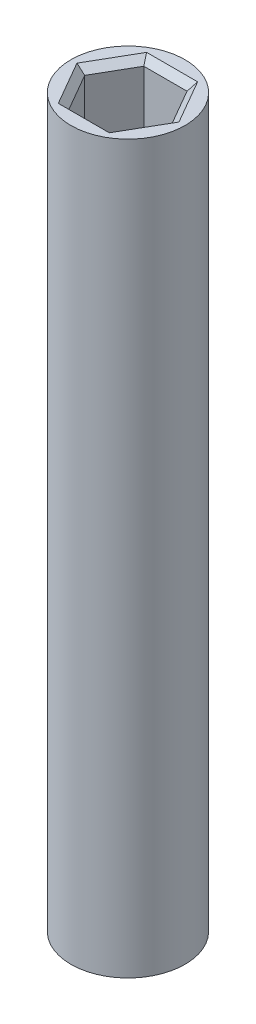
ISO-10303-21;
HEADER;
FILE_DESCRIPTION(('STEP AP214'),'2;1');
FILE_NAME('part.step','',(''),(''),'','','');
FILE_SCHEMA(('AUTOMOTIVE_DESIGN { 1 0 10303 214 1 1 1 1 }'));
ENDSEC;
DATA;
#1=APPLICATION_CONTEXT('core data for automotive mechanical design processes');
#2=APPLICATION_PROTOCOL_DEFINITION('international standard','automotive_design',2000,#1);
#3=PRODUCT_CONTEXT('',#1,'mechanical');
#4=PRODUCT('Part','Part','',(#3));
#5=PRODUCT_RELATED_PRODUCT_CATEGORY('part','',(#4));
#6=PRODUCT_DEFINITION_FORMATION('','',#4);
#7=PRODUCT_DEFINITION_CONTEXT('part definition',#1,'design');
#8=PRODUCT_DEFINITION('design','',#6,#7);
#9=PRODUCT_DEFINITION_SHAPE('','',#8);
#10=(LENGTH_UNIT() NAMED_UNIT(*) SI_UNIT(.MILLI.,.METRE.));
#11=(NAMED_UNIT(*) PLANE_ANGLE_UNIT() SI_UNIT($,.RADIAN.));
#12=(NAMED_UNIT(*) SI_UNIT($,.STERADIAN.) SOLID_ANGLE_UNIT());
#13=UNCERTAINTY_MEASURE_WITH_UNIT(LENGTH_MEASURE(1.E-05),#10,'distance_accuracy_value','');
#14=(GEOMETRIC_REPRESENTATION_CONTEXT(3) GLOBAL_UNCERTAINTY_ASSIGNED_CONTEXT((#13)) GLOBAL_UNIT_ASSIGNED_CONTEXT((#10,
#11,#12)) REPRESENTATION_CONTEXT('',''));
#15=CARTESIAN_POINT('',(0.,0.,0.));
#16=DIRECTION('',(0.,0.,1.));
#17=DIRECTION('',(1.,0.,0.));
#18=AXIS2_PLACEMENT_3D('',#15,#16,#17);
#19=CARTESIAN_POINT('',(0.,54.11518367,0.));
#20=DIRECTION('',(0.,-1.,0.));
#21=DIRECTION('',(0.,0.,-1.));
#22=AXIS2_PLACEMENT_3D('',#19,#20,#21);
#23=CYLINDRICAL_SURFACE('',#22,4.25);
#24=CARTESIAN_POINT('',(0.,54.11518367,0.));
#25=DIRECTION('',(0.,1.,0.));
#26=DIRECTION('',(0.,0.,1.));
#27=AXIS2_PLACEMENT_3D('',#24,#25,#26);
#28=CIRCLE('',#27,4.25);
#29=CARTESIAN_POINT('',(0.,54.11518367,4.25));
#30=VERTEX_POINT('',#29);
#31=EDGE_CURVE('E281',#30,#30,#28,.T.);
#32=ORIENTED_EDGE('',*,*,#31,.F.);
#33=EDGE_LOOP('',(#32));
#34=FACE_BOUND('',#33,.T.);
#35=CARTESIAN_POINT('',(0.,0.,0.));
#36=DIRECTION('',(0.,1.,0.));
#37=DIRECTION('',(0.,0.,1.));
#38=AXIS2_PLACEMENT_3D('',#35,#36,#37);
#39=CIRCLE('',#38,4.25);
#40=CARTESIAN_POINT('',(0.,0.,4.25));
#41=VERTEX_POINT('',#40);
#42=EDGE_CURVE('E261',#41,#41,#39,.T.);
#43=ORIENTED_EDGE('',*,*,#42,.T.);
#44=EDGE_LOOP('',(#43));
#45=FACE_BOUND('',#44,.T.);
#46=ADVANCED_FACE('F47',(#34,#45),#23,.T.);
#47=CARTESIAN_POINT('',(0.,54.11518367,0.));
#48=DIRECTION('',(0.,1.,0.));
#49=DIRECTION('',(0.,0.,1.));
#50=AXIS2_PLACEMENT_3D('',#47,#48,#49);
#51=PLANE('',#50);
#52=DIRECTION('',(-0.5,0.,0.866025403784439));
#53=VECTOR('',#52,1.);
#54=CARTESIAN_POINT('',(2.04381995293128,54.11518367,3.04));
#55=LINE('',#54,#53);
#56=CARTESIAN_POINT('',(3.79896477126774,54.11518367,0.));
#57=VERTEX_POINT('',#56);
#58=CARTESIAN_POINT('',(1.89948238563387,54.11518367,3.29));
#59=VERTEX_POINT('',#58);
#60=EDGE_CURVE('E304',#57,#59,#55,.T.);
#61=ORIENTED_EDGE('',*,*,#60,.T.);
#62=DIRECTION('',(-1.,0.,0.));
#63=VECTOR('',#62,1.);
#64=CARTESIAN_POINT('',(-1.61080725103906,54.11518367,3.29));
#65=LINE('',#64,#63);
#66=CARTESIAN_POINT('',(-1.89948238563387,54.11518367,3.29));
#67=VERTEX_POINT('',#66);
#68=EDGE_CURVE('E307',#59,#67,#65,.T.);
#69=ORIENTED_EDGE('',*,*,#68,.T.);
#70=DIRECTION('',(-0.5,0.,-0.866025403784439));
#71=VECTOR('',#70,1.);
#72=CARTESIAN_POINT('',(-3.65462720397033,54.11518367,0.250000000000002));
#73=LINE('',#72,#71);
#74=CARTESIAN_POINT('',(-3.79896477126774,54.11518367,0.));
#75=VERTEX_POINT('',#74);
#76=EDGE_CURVE('E295',#67,#75,#73,.T.);
#77=ORIENTED_EDGE('',*,*,#76,.T.);
#78=DIRECTION('',(0.5,0.,-0.866025403784439));
#79=VECTOR('',#78,1.);
#80=CARTESIAN_POINT('',(-2.04381995293128,54.11518367,-3.04));
#81=LINE('',#80,#79);
#82=CARTESIAN_POINT('',(-1.89948238563387,54.11518367,-3.29));
#83=VERTEX_POINT('',#82);
#84=EDGE_CURVE('E292',#75,#83,#81,.T.);
#85=ORIENTED_EDGE('',*,*,#84,.T.);
#86=DIRECTION('',(1.,0.,0.));
#87=VECTOR('',#86,1.);
#88=CARTESIAN_POINT('',(1.61080725103906,54.11518367,-3.29));
#89=LINE('',#88,#87);
#90=CARTESIAN_POINT('',(1.89948238563387,54.11518367,-3.29));
#91=VERTEX_POINT('',#90);
#92=EDGE_CURVE('E298',#83,#91,#89,.T.);
#93=ORIENTED_EDGE('',*,*,#92,.T.);
#94=DIRECTION('',(0.5,0.,0.866025403784439));
#95=VECTOR('',#94,1.);
#96=CARTESIAN_POINT('',(3.65462720397033,54.11518367,-0.25));
#97=LINE('',#96,#95);
#98=EDGE_CURVE('E301',#91,#57,#97,.T.);
#99=ORIENTED_EDGE('',*,*,#98,.T.);
#100=EDGE_LOOP('',(#61,#69,#77,#85,#93,#99));
#101=FACE_BOUND('',#100,.T.);
#102=ORIENTED_EDGE('',*,*,#31,.T.);
#103=EDGE_LOOP('',(#102));
#104=FACE_BOUND('',#103,.T.);
#105=ADVANCED_FACE('F442',(#101,#104),#51,.T.);
#106=CARTESIAN_POINT('',(0.,0.,0.));
#107=DIRECTION('',(0.,1.,0.));
#108=DIRECTION('',(0.,0.,1.));
#109=AXIS2_PLACEMENT_3D('',#106,#107,#108);
#110=PLANE('',#109);
#111=DIRECTION('',(0.573576436351044,0.,0.819152044288993));
#112=VECTOR('',#111,1.);
#113=CARTESIAN_POINT('',(-2.69501022571079,0.,1.88706647559494));
#114=LINE('',#113,#112);
#115=CARTESIAN_POINT('',(-3.78450856337425,0.,0.33110159631202));
#116=VERTEX_POINT('',#115);
#117=CARTESIAN_POINT('',(-1.60551188804734,0.,3.44303135487786));
#118=VERTEX_POINT('',#117);
#119=EDGE_CURVE('E362',#116,#118,#114,.T.);
#120=ORIENTED_EDGE('',*,*,#119,.T.);
#121=DIRECTION('',(0.996194698091746,0.,-0.0871557427476561));
#122=VECTOR('',#121,1.);
#123=CARTESIAN_POINT('',(0.286742393639789,0.,3.27748055672185));
#124=LINE('',#123,#122);
#125=CARTESIAN_POINT('',(2.17899667532691,0.,3.11192975856584));
#126=VERTEX_POINT('',#125);
#127=EDGE_CURVE('E365',#118,#126,#124,.T.);
#128=ORIENTED_EDGE('',*,*,#127,.T.);
#129=DIRECTION('',(0.422618261740701,0.,-0.906307787036649));
#130=VECTOR('',#129,1.);
#131=CARTESIAN_POINT('',(2.98175261935058,0.,1.39041408112691));
#132=LINE('',#131,#130);
#133=CARTESIAN_POINT('',(3.78450856337425,0.,-0.331101596312021));
#134=VERTEX_POINT('',#133);
#135=EDGE_CURVE('E350',#126,#134,#132,.T.);
#136=ORIENTED_EDGE('',*,*,#135,.T.);
#137=DIRECTION('',(-0.573576436351044,0.,-0.819152044288993));
#138=VECTOR('',#137,1.);
#139=CARTESIAN_POINT('',(2.69501022571079,0.,-1.88706647559494));
#140=LINE('',#139,#138);
#141=CARTESIAN_POINT('',(1.60551188804734,0.,-3.44303135487786));
#142=VERTEX_POINT('',#141);
#143=EDGE_CURVE('E353',#134,#142,#140,.T.);
#144=ORIENTED_EDGE('',*,*,#143,.T.);
#145=DIRECTION('',(-0.996194698091746,0.,0.0871557427476565));
#146=VECTOR('',#145,1.);
#147=CARTESIAN_POINT('',(-0.286742393639791,0.,-3.27748055672185));
#148=LINE('',#147,#146);
#149=CARTESIAN_POINT('',(-2.17899667532691,0.,-3.11192975856584));
#150=VERTEX_POINT('',#149);
#151=EDGE_CURVE('E356',#142,#150,#148,.T.);
#152=ORIENTED_EDGE('',*,*,#151,.T.);
#153=DIRECTION('',(-0.422618261740701,0.,0.906307787036649));
#154=VECTOR('',#153,1.);
#155=CARTESIAN_POINT('',(-2.98175261935058,0.,-1.39041408112691));
#156=LINE('',#155,#154);
#157=EDGE_CURVE('E359',#150,#116,#156,.T.);
#158=ORIENTED_EDGE('',*,*,#157,.T.);
#159=EDGE_LOOP('',(#120,#128,#136,#144,#152,#158));
#160=FACE_BOUND('',#159,.T.);
#161=ORIENTED_EDGE('',*,*,#42,.F.);
#162=EDGE_LOOP('',(#161));
#163=FACE_BOUND('',#162,.T.);
#164=ADVANCED_FACE('F429',(#160,#163),#110,.F.);
#165=CARTESIAN_POINT('',(-2.41621087655859,47.51518367,1.395));
#166=DIRECTION('',(-0.866025403784439,0.,0.5));
#167=DIRECTION('',(0.5,0.,0.866025403784439));
#168=AXIS2_PLACEMENT_3D('',#165,#166,#167);
#169=PLANE('',#168);
#170=DIRECTION('',(0.,1.,0.));
#171=VECTOR('',#170,1.);
#172=CARTESIAN_POINT('',(-3.22161450207811,47.51518367,0.));
#173=LINE('',#172,#171);
#174=CARTESIAN_POINT('',(-3.22161450207811,47.51518367,0.));
#175=VERTEX_POINT('',#174);
#176=CARTESIAN_POINT('',(-3.22161450207811,53.61518367,0.));
#177=VERTEX_POINT('',#176);
#178=EDGE_CURVE('E257',#175,#177,#173,.T.);
#179=ORIENTED_EDGE('',*,*,#178,.T.);
#180=DIRECTION('',(0.5,0.,0.866025403784439));
#181=VECTOR('',#180,1.);
#182=CARTESIAN_POINT('',(-1.61080725103906,53.61518367,2.79));
#183=LINE('',#182,#181);
#184=CARTESIAN_POINT('',(-1.61080725103906,53.61518367,2.79));
#185=VERTEX_POINT('',#184);
#186=EDGE_CURVE('E320',#177,#185,#183,.T.);
#187=ORIENTED_EDGE('',*,*,#186,.T.);
#188=DIRECTION('',(0.,1.,0.));
#189=VECTOR('',#188,1.);
#190=CARTESIAN_POINT('',(-1.61080725103906,47.51518367,2.79));
#191=LINE('',#190,#189);
#192=CARTESIAN_POINT('',(-1.61080725103906,47.51518367,2.79));
#193=VERTEX_POINT('',#192);
#194=EDGE_CURVE('E256',#193,#185,#191,.T.);
#195=ORIENTED_EDGE('',*,*,#194,.F.);
#196=DIRECTION('',(0.5,0.,0.866025403784439));
#197=VECTOR('',#196,1.);
#198=CARTESIAN_POINT('',(-2.41621087655859,47.51518367,1.395));
#199=LINE('',#198,#197);
#200=EDGE_CURVE('E231',#175,#193,#199,.T.);
#201=ORIENTED_EDGE('',*,*,#200,.F.);
#202=EDGE_LOOP('',(#179,#187,#195,#201));
#203=FACE_BOUND('',#202,.T.);
#204=ADVANCED_FACE('F520',(#203),#169,.F.);
#205=CARTESIAN_POINT('',(-2.41621087655858,47.51518367,-1.395));
#206=DIRECTION('',(-0.866025403784439,0.,-0.5));
#207=DIRECTION('',(-0.5,0.,0.866025403784438));
#208=AXIS2_PLACEMENT_3D('',#205,#206,#207);
#209=PLANE('',#208);
#210=DIRECTION('',(0.,1.,0.));
#211=VECTOR('',#210,1.);
#212=CARTESIAN_POINT('',(-1.61080725103906,47.51518367,-2.79));
#213=LINE('',#212,#211);
#214=CARTESIAN_POINT('',(-1.61080725103906,47.51518367,-2.79));
#215=VERTEX_POINT('',#214);
#216=CARTESIAN_POINT('',(-1.61080725103906,53.61518367,-2.79));
#217=VERTEX_POINT('',#216);
#218=EDGE_CURVE('E262',#215,#217,#213,.T.);
#219=ORIENTED_EDGE('',*,*,#218,.T.);
#220=DIRECTION('',(-0.5,0.,0.866025403784438));
#221=VECTOR('',#220,1.);
#222=CARTESIAN_POINT('',(-3.22161450207811,53.61518367,0.));
#223=LINE('',#222,#221);
#224=EDGE_CURVE('E323',#217,#177,#223,.T.);
#225=ORIENTED_EDGE('',*,*,#224,.T.);
#226=ORIENTED_EDGE('',*,*,#178,.F.);
#227=DIRECTION('',(-0.5,0.,0.866025403784439));
#228=VECTOR('',#227,1.);
#229=CARTESIAN_POINT('',(-2.41621087655858,47.51518367,-1.395));
#230=LINE('',#229,#228);
#231=EDGE_CURVE('E252',#215,#175,#230,.T.);
#232=ORIENTED_EDGE('',*,*,#231,.F.);
#233=EDGE_LOOP('',(#219,#225,#226,#232));
#234=FACE_BOUND('',#233,.T.);
#235=ADVANCED_FACE('F528',(#234),#209,.F.);
#236=CARTESIAN_POINT('',(0.,47.51518367,-2.79));
#237=DIRECTION('',(0.,0.,-1.));
#238=DIRECTION('',(-1.,0.,0.));
#239=AXIS2_PLACEMENT_3D('',#236,#237,#238);
#240=PLANE('',#239);
#241=DIRECTION('',(0.,1.,0.));
#242=VECTOR('',#241,1.);
#243=CARTESIAN_POINT('',(1.61080725103906,47.51518367,-2.79));
#244=LINE('',#243,#242);
#245=CARTESIAN_POINT('',(1.61080725103906,47.51518367,-2.79));
#246=VERTEX_POINT('',#245);
#247=CARTESIAN_POINT('',(1.61080725103906,53.61518367,-2.79));
#248=VERTEX_POINT('',#247);
#249=EDGE_CURVE('E266',#246,#248,#244,.T.);
#250=ORIENTED_EDGE('',*,*,#249,.T.);
#251=DIRECTION('',(-1.,0.,0.));
#252=VECTOR('',#251,1.);
#253=CARTESIAN_POINT('',(-1.61080725103906,53.61518367,-2.79));
#254=LINE('',#253,#252);
#255=EDGE_CURVE('E317',#248,#217,#254,.T.);
#256=ORIENTED_EDGE('',*,*,#255,.T.);
#257=ORIENTED_EDGE('',*,*,#218,.F.);
#258=DIRECTION('',(-1.,0.,0.));
#259=VECTOR('',#258,1.);
#260=CARTESIAN_POINT('',(0.,47.51518367,-2.79));
#261=LINE('',#260,#259);
#262=EDGE_CURVE('E248',#246,#215,#261,.T.);
#263=ORIENTED_EDGE('',*,*,#262,.F.);
#264=EDGE_LOOP('',(#250,#256,#257,#263));
#265=FACE_BOUND('',#264,.T.);
#266=ADVANCED_FACE('F530',(#265),#240,.F.);
#267=CARTESIAN_POINT('',(2.41621087655858,47.51518367,-1.395));
#268=DIRECTION('',(0.866025403784439,0.,-0.5));
#269=DIRECTION('',(-0.5,0.,-0.866025403784439));
#270=AXIS2_PLACEMENT_3D('',#267,#268,#269);
#271=PLANE('',#270);
#272=DIRECTION('',(0.,1.,0.));
#273=VECTOR('',#272,1.);
#274=CARTESIAN_POINT('',(3.22161450207811,47.51518367,0.));
#275=LINE('',#274,#273);
#276=CARTESIAN_POINT('',(3.22161450207811,47.51518367,0.));
#277=VERTEX_POINT('',#276);
#278=CARTESIAN_POINT('',(3.22161450207811,53.61518367,0.));
#279=VERTEX_POINT('',#278);
#280=EDGE_CURVE('E270',#277,#279,#275,.T.);
#281=ORIENTED_EDGE('',*,*,#280,.T.);
#282=DIRECTION('',(-0.5,0.,-0.866025403784439));
#283=VECTOR('',#282,1.);
#284=CARTESIAN_POINT('',(1.61080725103906,53.61518367,-2.79));
#285=LINE('',#284,#283);
#286=EDGE_CURVE('E314',#279,#248,#285,.T.);
#287=ORIENTED_EDGE('',*,*,#286,.T.);
#288=ORIENTED_EDGE('',*,*,#249,.F.);
#289=DIRECTION('',(-0.5,0.,-0.866025403784439));
#290=VECTOR('',#289,1.);
#291=CARTESIAN_POINT('',(2.41621087655858,47.51518367,-1.395));
#292=LINE('',#291,#290);
#293=EDGE_CURVE('E244',#277,#246,#292,.T.);
#294=ORIENTED_EDGE('',*,*,#293,.F.);
#295=EDGE_LOOP('',(#281,#287,#288,#294));
#296=FACE_BOUND('',#295,.T.);
#297=ADVANCED_FACE('F533',(#296),#271,.F.);
#298=CARTESIAN_POINT('',(2.41621087655858,47.51518367,1.395));
#299=DIRECTION('',(0.866025403784438,0.,0.5));
#300=DIRECTION('',(0.5,0.,-0.866025403784438));
#301=AXIS2_PLACEMENT_3D('',#298,#299,#300);
#302=PLANE('',#301);
#303=DIRECTION('',(0.,1.,0.));
#304=VECTOR('',#303,1.);
#305=CARTESIAN_POINT('',(1.61080725103906,47.51518367,2.79));
#306=LINE('',#305,#304);
#307=CARTESIAN_POINT('',(1.61080725103906,47.51518367,2.79));
#308=VERTEX_POINT('',#307);
#309=CARTESIAN_POINT('',(1.61080725103906,53.61518367,2.79));
#310=VERTEX_POINT('',#309);
#311=EDGE_CURVE('E274',#308,#310,#306,.T.);
#312=ORIENTED_EDGE('',*,*,#311,.T.);
#313=DIRECTION('',(0.5,0.,-0.866025403784438));
#314=VECTOR('',#313,1.);
#315=CARTESIAN_POINT('',(3.22161450207811,53.61518367,0.));
#316=LINE('',#315,#314);
#317=EDGE_CURVE('E311',#310,#279,#316,.T.);
#318=ORIENTED_EDGE('',*,*,#317,.T.);
#319=ORIENTED_EDGE('',*,*,#280,.F.);
#320=DIRECTION('',(0.5,0.,-0.866025403784438));
#321=VECTOR('',#320,1.);
#322=CARTESIAN_POINT('',(2.41621087655858,47.51518367,1.395));
#323=LINE('',#322,#321);
#324=EDGE_CURVE('E240',#308,#277,#323,.T.);
#325=ORIENTED_EDGE('',*,*,#324,.F.);
#326=EDGE_LOOP('',(#312,#318,#319,#325));
#327=FACE_BOUND('',#326,.T.);
#328=ADVANCED_FACE('F537',(#327),#302,.F.);
#329=CARTESIAN_POINT('',(0.,47.51518367,2.79));
#330=DIRECTION('',(0.,0.,1.));
#331=DIRECTION('',(1.,0.,0.));
#332=AXIS2_PLACEMENT_3D('',#329,#330,#331);
#333=PLANE('',#332);
#334=ORIENTED_EDGE('',*,*,#194,.T.);
#335=DIRECTION('',(1.,0.,0.));
#336=VECTOR('',#335,1.);
#337=CARTESIAN_POINT('',(1.61080725103906,53.61518367,2.79));
#338=LINE('',#337,#336);
#339=EDGE_CURVE('E285',#185,#310,#338,.T.);
#340=ORIENTED_EDGE('',*,*,#339,.T.);
#341=ORIENTED_EDGE('',*,*,#311,.F.);
#342=DIRECTION('',(1.,0.,0.));
#343=VECTOR('',#342,1.);
#344=CARTESIAN_POINT('',(0.,47.51518367,2.79));
#345=LINE('',#344,#343);
#346=EDGE_CURVE('E235',#193,#308,#345,.T.);
#347=ORIENTED_EDGE('',*,*,#346,.F.);
#348=EDGE_LOOP('',(#334,#340,#341,#347));
#349=FACE_BOUND('',#348,.T.);
#350=ADVANCED_FACE('F499',(#349),#333,.F.);
#351=CARTESIAN_POINT('',(0.,47.51518367,0.));
#352=DIRECTION('',(0.,1.,0.));
#353=DIRECTION('',(0.,0.,1.));
#354=AXIS2_PLACEMENT_3D('',#351,#352,#353);
#355=PLANE('',#354);
#356=ORIENTED_EDGE('',*,*,#200,.T.);
#357=ORIENTED_EDGE('',*,*,#346,.T.);
#358=ORIENTED_EDGE('',*,*,#324,.T.);
#359=ORIENTED_EDGE('',*,*,#293,.T.);
#360=ORIENTED_EDGE('',*,*,#262,.T.);
#361=ORIENTED_EDGE('',*,*,#231,.T.);
#362=EDGE_LOOP('',(#356,#357,#358,#359,#360,#361));
#363=FACE_BOUND('',#362,.T.);
#364=ADVANCED_FACE('F494',(#363),#355,.T.);
#365=CARTESIAN_POINT('',(0.,53.61518367,-2.79));
#366=DIRECTION('',(0.,0.707106781186549,0.707106781186546));
#367=DIRECTION('',(1.,0.,0.));
#368=AXIS2_PLACEMENT_3D('',#365,#366,#367);
#369=PLANE('',#368);
#370=DIRECTION('',(0.377964473009227,0.654653670707976,-0.654653670707978));
#371=VECTOR('',#370,1.);
#372=CARTESIAN_POINT('',(1.38069192946205,53.2166122414286,-2.39142857142857));
#373=LINE('',#372,#371);
#374=EDGE_CURVE('E340',#91,#248,#373,.F.);
#375=ORIENTED_EDGE('',*,*,#374,.F.);
#376=ORIENTED_EDGE('',*,*,#92,.F.);
#377=DIRECTION('',(-0.377964473009229,0.654653670707976,-0.654653670707978));
#378=VECTOR('',#377,1.);
#379=CARTESIAN_POINT('',(-1.38069192946205,53.2166122414286,-2.39142857142857));
#380=LINE('',#379,#378);
#381=EDGE_CURVE('E236',#217,#83,#380,.T.);
#382=ORIENTED_EDGE('',*,*,#381,.F.);
#383=ORIENTED_EDGE('',*,*,#255,.F.);
#384=EDGE_LOOP('',(#375,#376,#382,#383));
#385=FACE_BOUND('',#384,.T.);
#386=ADVANCED_FACE('F489',(#385),#369,.T.);
#387=CARTESIAN_POINT('',(-2.41621087655858,53.61518367,-1.395));
#388=DIRECTION('',(0.612372435695793,0.707106781186549,0.353553390593273));
#389=DIRECTION('',(0.5,0.,-0.866025403784438));
#390=AXIS2_PLACEMENT_3D('',#387,#388,#389);
#391=PLANE('',#390);
#392=ORIENTED_EDGE('',*,*,#381,.T.);
#393=ORIENTED_EDGE('',*,*,#84,.F.);
#394=DIRECTION('',(0.755928946018456,-0.654653670707976,0.));
#395=VECTOR('',#394,1.);
#396=CARTESIAN_POINT('',(-2.76138385892409,53.2166122414286,0.));
#397=LINE('',#396,#395);
#398=EDGE_CURVE('E336',#177,#75,#397,.F.);
#399=ORIENTED_EDGE('',*,*,#398,.F.);
#400=ORIENTED_EDGE('',*,*,#224,.F.);
#401=EDGE_LOOP('',(#392,#393,#399,#400));
#402=FACE_BOUND('',#401,.T.);
#403=ADVANCED_FACE('F483',(#402),#391,.T.);
#404=CARTESIAN_POINT('',(2.41621087655858,53.61518367,-1.395));
#405=DIRECTION('',(-0.612372435695794,0.707106781186548,0.353553390593273));
#406=DIRECTION('',(0.5,0.,0.866025403784439));
#407=AXIS2_PLACEMENT_3D('',#404,#405,#406);
#408=PLANE('',#407);
#409=ORIENTED_EDGE('',*,*,#374,.T.);
#410=ORIENTED_EDGE('',*,*,#286,.F.);
#411=DIRECTION('',(0.755928946018455,0.654653670707976,0.));
#412=VECTOR('',#411,1.);
#413=CARTESIAN_POINT('',(2.7613838589241,53.2166122414286,0.));
#414=LINE('',#413,#412);
#415=EDGE_CURVE('E332',#57,#279,#414,.F.);
#416=ORIENTED_EDGE('',*,*,#415,.F.);
#417=ORIENTED_EDGE('',*,*,#98,.F.);
#418=EDGE_LOOP('',(#409,#410,#416,#417));
#419=FACE_BOUND('',#418,.T.);
#420=ADVANCED_FACE('F476',(#419),#408,.T.);
#421=CARTESIAN_POINT('',(-2.41621087655859,53.61518367,1.395));
#422=DIRECTION('',(0.612372435695793,0.707106781186549,-0.353553390593273));
#423=DIRECTION('',(-0.5,0.,-0.866025403784439));
#424=AXIS2_PLACEMENT_3D('',#421,#422,#423);
#425=PLANE('',#424);
#426=ORIENTED_EDGE('',*,*,#398,.T.);
#427=ORIENTED_EDGE('',*,*,#76,.F.);
#428=DIRECTION('',(0.377964473009228,-0.654653670707976,-0.654653670707978));
#429=VECTOR('',#428,1.);
#430=CARTESIAN_POINT('',(-1.38069192946205,53.2166122414286,2.39142857142857));
#431=LINE('',#430,#429);
#432=EDGE_CURVE('E329',#185,#67,#431,.F.);
#433=ORIENTED_EDGE('',*,*,#432,.F.);
#434=ORIENTED_EDGE('',*,*,#186,.F.);
#435=EDGE_LOOP('',(#426,#427,#433,#434));
#436=FACE_BOUND('',#435,.T.);
#437=ADVANCED_FACE('F469',(#436),#425,.T.);
#438=CARTESIAN_POINT('',(2.41621087655858,53.61518367,1.395));
#439=DIRECTION('',(-0.612372435695793,0.707106781186549,-0.353553390593273));
#440=DIRECTION('',(-0.5,0.,0.866025403784438));
#441=AXIS2_PLACEMENT_3D('',#438,#439,#440);
#442=PLANE('',#441);
#443=ORIENTED_EDGE('',*,*,#415,.T.);
#444=ORIENTED_EDGE('',*,*,#317,.F.);
#445=DIRECTION('',(0.377964473009228,0.654653670707976,0.654653670707978));
#446=VECTOR('',#445,1.);
#447=CARTESIAN_POINT('',(1.38069192946205,53.2166122414286,2.39142857142857));
#448=LINE('',#447,#446);
#449=EDGE_CURVE('E216',#59,#310,#448,.F.);
#450=ORIENTED_EDGE('',*,*,#449,.F.);
#451=ORIENTED_EDGE('',*,*,#60,.F.);
#452=EDGE_LOOP('',(#443,#444,#450,#451));
#453=FACE_BOUND('',#452,.T.);
#454=ADVANCED_FACE('F462',(#453),#442,.T.);
#455=CARTESIAN_POINT('',(0.,53.61518367,2.79));
#456=DIRECTION('',(0.,0.707106781186549,-0.707106781186546));
#457=DIRECTION('',(-1.,0.,0.));
#458=AXIS2_PLACEMENT_3D('',#455,#456,#457);
#459=PLANE('',#458);
#460=ORIENTED_EDGE('',*,*,#432,.T.);
#461=ORIENTED_EDGE('',*,*,#68,.F.);
#462=ORIENTED_EDGE('',*,*,#449,.T.);
#463=ORIENTED_EDGE('',*,*,#339,.F.);
#464=EDGE_LOOP('',(#460,#461,#462,#463));
#465=FACE_BOUND('',#464,.T.);
#466=ADVANCED_FACE('F456',(#465),#459,.T.);
#467=CARTESIAN_POINT('',(-0.243164522265962,6.6,-2.77938320767597));
#468=DIRECTION('',(-0.0871557427476566,0.,-0.996194698091746));
#469=DIRECTION('',(-0.996194698091746,0.,0.0871557427476566));
#470=AXIS2_PLACEMENT_3D('',#467,#468,#469);
#471=PLANE('',#470);
#472=DIRECTION('',(0.,-1.,0.));
#473=VECTOR('',#472,1.);
#474=CARTESIAN_POINT('',(-1.84784216539881,6.6,-2.63899210528835));
#475=LINE('',#474,#473);
#476=CARTESIAN_POINT('',(-1.84784216539881,6.6,-2.63899210528835));
#477=VERTEX_POINT('',#476);
#478=CARTESIAN_POINT('',(-1.84784216539881,0.5,-2.63899210528835));
#479=VERTEX_POINT('',#478);
#480=EDGE_CURVE('E213',#477,#479,#475,.T.);
#481=ORIENTED_EDGE('',*,*,#480,.T.);
#482=DIRECTION('',(0.996194698091746,0.,-0.0871557427476566));
#483=VECTOR('',#482,1.);
#484=CARTESIAN_POINT('',(-0.243164522265962,0.5,-2.77938320767597));
#485=LINE('',#484,#483);
#486=CARTESIAN_POINT('',(1.36151312086689,0.5,-2.91977431006359));
#487=VERTEX_POINT('',#486);
#488=EDGE_CURVE('E73',#479,#487,#485,.T.);
#489=ORIENTED_EDGE('',*,*,#488,.T.);
#490=DIRECTION('',(0.,-1.,0.));
#491=VECTOR('',#490,1.);
#492=CARTESIAN_POINT('',(1.36151312086689,6.6,-2.91977431006359));
#493=LINE('',#492,#491);
#494=CARTESIAN_POINT('',(1.36151312086689,6.6,-2.91977431006359));
#495=VERTEX_POINT('',#494);
#496=EDGE_CURVE('E173',#495,#487,#493,.T.);
#497=ORIENTED_EDGE('',*,*,#496,.F.);
#498=DIRECTION('',(0.996194698091746,0.,-0.0871557427476566));
#499=VECTOR('',#498,1.);
#500=CARTESIAN_POINT('',(-0.243164522265962,6.6,-2.77938320767597));
#501=LINE('',#500,#499);
#502=EDGE_CURVE('E177',#477,#495,#501,.T.);
#503=ORIENTED_EDGE('',*,*,#502,.F.);
#504=EDGE_LOOP('',(#481,#489,#497,#503));
#505=FACE_BOUND('',#504,.T.);
#506=ADVANCED_FACE('F175',(#505),#471,.F.);
#507=CARTESIAN_POINT('',(-2.52859872583225,6.6,-1.17910495025656));
#508=DIRECTION('',(-0.906307787036649,0.,-0.422618261740701));
#509=DIRECTION('',(-0.422618261740701,0.,0.906307787036649));
#510=AXIS2_PLACEMENT_3D('',#507,#508,#509);
#511=PLANE('',#510);
#512=DIRECTION('',(0.,-1.,0.));
#513=VECTOR('',#512,1.);
#514=CARTESIAN_POINT('',(-3.20935528626569,6.6,0.280782204775238));
#515=LINE('',#514,#513);
#516=CARTESIAN_POINT('',(-3.20935528626569,6.6,0.280782204775238));
#517=VERTEX_POINT('',#516);
#518=CARTESIAN_POINT('',(-3.20935528626569,0.5,0.280782204775238));
#519=VERTEX_POINT('',#518);
#520=EDGE_CURVE('E217',#517,#519,#515,.T.);
#521=ORIENTED_EDGE('',*,*,#520,.T.);
#522=DIRECTION('',(0.422618261740701,0.,-0.906307787036649));
#523=VECTOR('',#522,1.);
#524=CARTESIAN_POINT('',(-2.52859872583225,0.5,-1.17910495025656));
#525=LINE('',#524,#523);
#526=EDGE_CURVE('E372',#519,#479,#525,.T.);
#527=ORIENTED_EDGE('',*,*,#526,.T.);
#528=ORIENTED_EDGE('',*,*,#480,.F.);
#529=DIRECTION('',(0.422618261740701,0.,-0.906307787036649));
#530=VECTOR('',#529,1.);
#531=CARTESIAN_POINT('',(-2.52859872583225,6.6,-1.17910495025656));
#532=LINE('',#531,#530);
#533=EDGE_CURVE('E182',#517,#477,#532,.T.);
#534=ORIENTED_EDGE('',*,*,#533,.F.);
#535=EDGE_LOOP('',(#521,#527,#528,#534));
#536=FACE_BOUND('',#535,.T.);
#537=ADVANCED_FACE('F420',(#536),#511,.F.);
#538=CARTESIAN_POINT('',(-2.28543420356629,6.6,1.60027825741941));
#539=DIRECTION('',(-0.819152044288993,0.,0.573576436351044));
#540=DIRECTION('',(0.573576436351044,0.,0.819152044288993));
#541=AXIS2_PLACEMENT_3D('',#538,#539,#540);
#542=PLANE('',#541);
#543=DIRECTION('',(0.,-1.,0.));
#544=VECTOR('',#543,1.);
#545=CARTESIAN_POINT('',(-1.36151312086689,6.6,2.91977431006359));
#546=LINE('',#545,#544);
#547=CARTESIAN_POINT('',(-1.36151312086689,6.6,2.91977431006359));
#548=VERTEX_POINT('',#547);
#549=CARTESIAN_POINT('',(-1.36151312086689,0.5,2.91977431006359));
#550=VERTEX_POINT('',#549);
#551=EDGE_CURVE('E221',#548,#550,#546,.T.);
#552=ORIENTED_EDGE('',*,*,#551,.T.);
#553=DIRECTION('',(-0.573576436351044,0.,-0.819152044288993));
#554=VECTOR('',#553,1.);
#555=CARTESIAN_POINT('',(-2.28543420356629,0.5,1.60027825741941));
#556=LINE('',#555,#554);
#557=EDGE_CURVE('E369',#550,#519,#556,.T.);
#558=ORIENTED_EDGE('',*,*,#557,.T.);
#559=ORIENTED_EDGE('',*,*,#520,.F.);
#560=DIRECTION('',(-0.573576436351044,0.,-0.819152044288993));
#561=VECTOR('',#560,1.);
#562=CARTESIAN_POINT('',(-2.28543420356629,6.6,1.60027825741941));
#563=LINE('',#562,#561);
#564=EDGE_CURVE('E208',#548,#517,#563,.T.);
#565=ORIENTED_EDGE('',*,*,#564,.F.);
#566=EDGE_LOOP('',(#552,#558,#559,#565));
#567=FACE_BOUND('',#566,.T.);
#568=ADVANCED_FACE('F421',(#567),#542,.F.);
#569=CARTESIAN_POINT('',(0.24316452226596,6.6,2.77938320767597));
#570=DIRECTION('',(0.0871557427476561,0.,0.996194698091746));
#571=DIRECTION('',(0.996194698091746,0.,-0.087155742747656));
#572=AXIS2_PLACEMENT_3D('',#569,#570,#571);
#573=PLANE('',#572);
#574=DIRECTION('',(0.,-1.,0.));
#575=VECTOR('',#574,1.);
#576=CARTESIAN_POINT('',(1.84784216539881,6.6,2.63899210528835));
#577=LINE('',#576,#575);
#578=CARTESIAN_POINT('',(1.84784216539881,6.6,2.63899210528835));
#579=VERTEX_POINT('',#578);
#580=CARTESIAN_POINT('',(1.84784216539881,0.5,2.63899210528835));
#581=VERTEX_POINT('',#580);
#582=EDGE_CURVE('E225',#579,#581,#577,.T.);
#583=ORIENTED_EDGE('',*,*,#582,.T.);
#584=DIRECTION('',(-0.996194698091746,0.,0.087155742747656));
#585=VECTOR('',#584,1.);
#586=CARTESIAN_POINT('',(0.24316452226596,0.5,2.77938320767597));
#587=LINE('',#586,#585);
#588=EDGE_CURVE('E326',#581,#550,#587,.T.);
#589=ORIENTED_EDGE('',*,*,#588,.T.);
#590=ORIENTED_EDGE('',*,*,#551,.F.);
#591=DIRECTION('',(-0.996194698091746,0.,0.0871557427476561));
#592=VECTOR('',#591,1.);
#593=CARTESIAN_POINT('',(0.24316452226596,6.6,2.77938320767597));
#594=LINE('',#593,#592);
#595=EDGE_CURVE('E204',#579,#548,#594,.T.);
#596=ORIENTED_EDGE('',*,*,#595,.F.);
#597=EDGE_LOOP('',(#583,#589,#590,#596));
#598=FACE_BOUND('',#597,.T.);
#599=ADVANCED_FACE('F416',(#598),#573,.F.);
#600=CARTESIAN_POINT('',(2.52859872583225,6.6,1.17910495025656));
#601=DIRECTION('',(0.906307787036649,0.,0.422618261740701));
#602=DIRECTION('',(0.422618261740701,0.,-0.906307787036649));
#603=AXIS2_PLACEMENT_3D('',#600,#601,#602);
#604=PLANE('',#603);
#605=DIRECTION('',(0.,-1.,0.));
#606=VECTOR('',#605,1.);
#607=CARTESIAN_POINT('',(3.20935528626569,6.6,-0.280782204775239));
#608=LINE('',#607,#606);
#609=CARTESIAN_POINT('',(3.20935528626569,6.6,-0.280782204775239));
#610=VERTEX_POINT('',#609);
#611=CARTESIAN_POINT('',(3.20935528626569,0.5,-0.280782204775239));
#612=VERTEX_POINT('',#611);
#613=EDGE_CURVE('E181',#610,#612,#608,.T.);
#614=ORIENTED_EDGE('',*,*,#613,.T.);
#615=DIRECTION('',(-0.422618261740701,0.,0.906307787036649));
#616=VECTOR('',#615,1.);
#617=CARTESIAN_POINT('',(2.52859872583225,0.5,1.17910495025656));
#618=LINE('',#617,#616);
#619=EDGE_CURVE('E11',#612,#581,#618,.T.);
#620=ORIENTED_EDGE('',*,*,#619,.T.);
#621=ORIENTED_EDGE('',*,*,#582,.F.);
#622=DIRECTION('',(-0.422618261740701,0.,0.906307787036649));
#623=VECTOR('',#622,1.);
#624=CARTESIAN_POINT('',(2.52859872583225,6.6,1.17910495025656));
#625=LINE('',#624,#623);
#626=EDGE_CURVE('E191',#610,#579,#625,.T.);
#627=ORIENTED_EDGE('',*,*,#626,.F.);
#628=EDGE_LOOP('',(#614,#620,#621,#627));
#629=FACE_BOUND('',#628,.T.);
#630=ADVANCED_FACE('F413',(#629),#604,.F.);
#631=CARTESIAN_POINT('',(2.28543420356629,6.6,-1.60027825741941));
#632=DIRECTION('',(0.819152044288993,0.,-0.573576436351044));
#633=DIRECTION('',(-0.573576436351044,0.,-0.819152044288993));
#634=AXIS2_PLACEMENT_3D('',#631,#632,#633);
#635=PLANE('',#634);
#636=ORIENTED_EDGE('',*,*,#496,.T.);
#637=DIRECTION('',(0.573576436351044,0.,0.819152044288993));
#638=VECTOR('',#637,1.);
#639=CARTESIAN_POINT('',(2.28543420356629,0.5,-1.60027825741941));
#640=LINE('',#639,#638);
#641=EDGE_CURVE('E58',#487,#612,#640,.T.);
#642=ORIENTED_EDGE('',*,*,#641,.T.);
#643=ORIENTED_EDGE('',*,*,#613,.F.);
#644=DIRECTION('',(0.573576436351044,0.,0.819152044288993));
#645=VECTOR('',#644,1.);
#646=CARTESIAN_POINT('',(2.28543420356629,6.6,-1.60027825741941));
#647=LINE('',#646,#645);
#648=EDGE_CURVE('E185',#495,#610,#647,.T.);
#649=ORIENTED_EDGE('',*,*,#648,.F.);
#650=EDGE_LOOP('',(#636,#642,#643,#649));
#651=FACE_BOUND('',#650,.T.);
#652=ADVANCED_FACE('F186',(#651),#635,.F.);
#653=CARTESIAN_POINT('',(0.,6.6,0.));
#654=DIRECTION('',(0.,-1.,0.));
#655=DIRECTION('',(0.,0.,-1.));
#656=AXIS2_PLACEMENT_3D('',#653,#654,#655);
#657=PLANE('',#656);
#658=ORIENTED_EDGE('',*,*,#502,.T.);
#659=ORIENTED_EDGE('',*,*,#648,.T.);
#660=ORIENTED_EDGE('',*,*,#626,.T.);
#661=ORIENTED_EDGE('',*,*,#595,.T.);
#662=ORIENTED_EDGE('',*,*,#564,.T.);
#663=ORIENTED_EDGE('',*,*,#533,.T.);
#664=EDGE_LOOP('',(#658,#659,#660,#661,#662,#663));
#665=FACE_BOUND('',#664,.T.);
#666=ADVANCED_FACE('F193',(#665),#657,.T.);
#667=CARTESIAN_POINT('',(-0.243164522265962,0.5,-2.77938320767597));
#668=DIRECTION('',(-0.0616284167162177,0.707106781186553,-0.704416026402753));
#669=DIRECTION('',(0.996194698091746,0.,-0.0871557427476566));
#670=AXIS2_PLACEMENT_3D('',#667,#668,#669);
#671=PLANE('',#670);
#672=DIRECTION('',(-0.433583030991869,-0.654653670707972,-0.619220741468245));
#673=VECTOR('',#672,1.);
#674=CARTESIAN_POINT('',(-1.58386471319898,0.898571428571429,-2.2619932331043));
#675=LINE('',#674,#673);
#676=EDGE_CURVE('E200',#150,#479,#675,.F.);
#677=ORIENTED_EDGE('',*,*,#676,.F.);
#678=ORIENTED_EDGE('',*,*,#151,.F.);
#679=DIRECTION('',(0.319469377165802,-0.654653670707971,-0.685104290222936));
#680=VECTOR('',#679,1.);
#681=CARTESIAN_POINT('',(1.16701124645733,0.898571428571429,-2.50266369434021));
#682=LINE('',#681,#680);
#683=EDGE_CURVE('E52',#487,#142,#682,.T.);
#684=ORIENTED_EDGE('',*,*,#683,.F.);
#685=ORIENTED_EDGE('',*,*,#488,.F.);
#686=EDGE_LOOP('',(#677,#678,#684,#685));
#687=FACE_BOUND('',#686,.T.);
#688=ADVANCED_FACE('F50',(#687),#671,.F.);
#689=CARTESIAN_POINT('',(2.28543420356629,0.5,-1.60027825741941));
#690=DIRECTION('',(0.579227965339566,0.707106781186553,-0.405579787672635));
#691=DIRECTION('',(0.573576436351044,0.,0.819152044288993));
#692=AXIS2_PLACEMENT_3D('',#689,#690,#691);
#693=PLANE('',#692);
#694=ORIENTED_EDGE('',*,*,#683,.T.);
#695=ORIENTED_EDGE('',*,*,#143,.F.);
#696=DIRECTION('',(0.753052408157671,-0.654653670707972,-0.0658835487546923));
#697=VECTOR('',#696,1.);
#698=CARTESIAN_POINT('',(2.7508759596563,0.898571428571427,-0.240670461235919));
#699=LINE('',#698,#697);
#700=EDGE_CURVE('E389',#612,#134,#699,.T.);
#701=ORIENTED_EDGE('',*,*,#700,.F.);
#702=ORIENTED_EDGE('',*,*,#641,.F.);
#703=EDGE_LOOP('',(#694,#695,#701,#702));
#704=FACE_BOUND('',#703,.T.);
#705=ADVANCED_FACE('F405',(#704),#693,.F.);
#706=CARTESIAN_POINT('',(-2.52859872583225,0.5,-1.17910495025656));
#707=DIRECTION('',(-0.640856382055784,0.707106781186552,-0.298836238730119));
#708=DIRECTION('',(0.422618261740701,0.,-0.906307787036649));
#709=AXIS2_PLACEMENT_3D('',#706,#707,#708);
#710=PLANE('',#709);
#711=ORIENTED_EDGE('',*,*,#676,.T.);
#712=ORIENTED_EDGE('',*,*,#526,.F.);
#713=DIRECTION('',(-0.75305240815767,-0.654653670707972,0.0658835487546925));
#714=VECTOR('',#713,1.);
#715=CARTESIAN_POINT('',(-2.7508759596563,0.898571428571427,0.240670461235917));
#716=LINE('',#715,#714);
#717=EDGE_CURVE('E385',#116,#519,#716,.F.);
#718=ORIENTED_EDGE('',*,*,#717,.F.);
#719=ORIENTED_EDGE('',*,*,#157,.F.);
#720=EDGE_LOOP('',(#711,#712,#718,#719));
#721=FACE_BOUND('',#720,.T.);
#722=ADVANCED_FACE('F398',(#721),#710,.F.);
#723=CARTESIAN_POINT('',(2.52859872583225,0.5,1.17910495025656));
#724=DIRECTION('',(0.640856382055783,0.707106781186553,0.298836238730119));
#725=DIRECTION('',(-0.422618261740701,0.,0.906307787036649));
#726=AXIS2_PLACEMENT_3D('',#723,#724,#725);
#727=PLANE('',#726);
#728=ORIENTED_EDGE('',*,*,#700,.T.);
#729=ORIENTED_EDGE('',*,*,#135,.F.);
#730=DIRECTION('',(-0.433583030991869,0.654653670707971,-0.619220741468245));
#731=VECTOR('',#730,1.);
#732=CARTESIAN_POINT('',(1.58386471319897,0.898571428571428,2.2619932331043));
#733=LINE('',#732,#731);
#734=EDGE_CURVE('E382',#581,#126,#733,.F.);
#735=ORIENTED_EDGE('',*,*,#734,.F.);
#736=ORIENTED_EDGE('',*,*,#619,.F.);
#737=EDGE_LOOP('',(#728,#729,#735,#736));
#738=FACE_BOUND('',#737,.T.);
#739=ADVANCED_FACE('F410',(#738),#727,.F.);
#740=CARTESIAN_POINT('',(-2.28543420356629,0.5,1.60027825741941));
#741=DIRECTION('',(-0.579227965339566,0.707106781186553,0.405579787672634));
#742=DIRECTION('',(-0.573576436351044,0.,-0.819152044288993));
#743=AXIS2_PLACEMENT_3D('',#740,#741,#742);
#744=PLANE('',#743);
#745=ORIENTED_EDGE('',*,*,#717,.T.);
#746=ORIENTED_EDGE('',*,*,#557,.F.);
#747=DIRECTION('',(-0.319469377165801,-0.654653670707971,0.685104290222937));
#748=VECTOR('',#747,1.);
#749=CARTESIAN_POINT('',(-1.16701124645733,0.898571428571428,2.50266369434022));
#750=LINE('',#749,#748);
#751=EDGE_CURVE('E379',#118,#550,#750,.F.);
#752=ORIENTED_EDGE('',*,*,#751,.F.);
#753=ORIENTED_EDGE('',*,*,#119,.F.);
#754=EDGE_LOOP('',(#745,#746,#752,#753));
#755=FACE_BOUND('',#754,.T.);
#756=ADVANCED_FACE('F425',(#755),#744,.F.);
#757=CARTESIAN_POINT('',(0.24316452226596,0.5,2.77938320767597));
#758=DIRECTION('',(0.0616284167162174,0.707106781186553,0.704416026402753));
#759=DIRECTION('',(-0.996194698091746,0.,0.087155742747656));
#760=AXIS2_PLACEMENT_3D('',#757,#758,#759);
#761=PLANE('',#760);
#762=ORIENTED_EDGE('',*,*,#734,.T.);
#763=ORIENTED_EDGE('',*,*,#127,.F.);
#764=ORIENTED_EDGE('',*,*,#751,.T.);
#765=ORIENTED_EDGE('',*,*,#588,.F.);
#766=EDGE_LOOP('',(#762,#763,#764,#765));
#767=FACE_BOUND('',#766,.T.);
#768=ADVANCED_FACE('F432',(#767),#761,.F.);
#769=CLOSED_SHELL('',(#46,#105,#164,#204,#235,#266,#297,#328,#350,#364,#386,#403,#420,#437,#454,
#466,#506,#537,#568,#599,#630,#652,#666,#688,#705,#722,#739,#756,#768));
#770=MANIFOLD_SOLID_BREP('B2',#769);
#771=ADVANCED_BREP_SHAPE_REPRESENTATION('',(#18,#770),#14);
#772=SHAPE_DEFINITION_REPRESENTATION(#9,#771);
ENDSEC;
END-ISO-10303-21;
